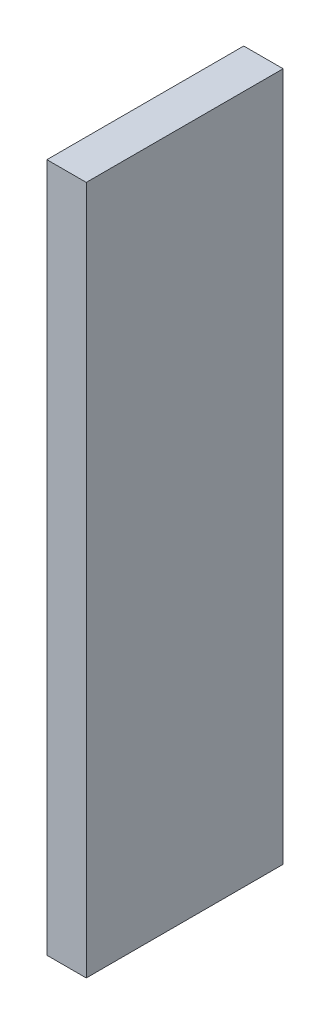
ISO-10303-21;
HEADER;
FILE_DESCRIPTION(('STEP AP214'),'2;1');
FILE_NAME('part.step','',(''),(''),'','','');
FILE_SCHEMA(('AUTOMOTIVE_DESIGN { 1 0 10303 214 1 1 1 1 }'));
ENDSEC;
DATA;
#1=APPLICATION_CONTEXT('core data for automotive mechanical design processes');
#2=APPLICATION_PROTOCOL_DEFINITION('international standard','automotive_design',2000,#1);
#3=PRODUCT_CONTEXT('',#1,'mechanical');
#4=PRODUCT('Part','Part','',(#3));
#5=PRODUCT_RELATED_PRODUCT_CATEGORY('part','',(#4));
#6=PRODUCT_DEFINITION_FORMATION('','',#4);
#7=PRODUCT_DEFINITION_CONTEXT('part definition',#1,'design');
#8=PRODUCT_DEFINITION('design','',#6,#7);
#9=PRODUCT_DEFINITION_SHAPE('','',#8);
#10=(LENGTH_UNIT() NAMED_UNIT(*) SI_UNIT(.MILLI.,.METRE.));
#11=(NAMED_UNIT(*) PLANE_ANGLE_UNIT() SI_UNIT($,.RADIAN.));
#12=(NAMED_UNIT(*) SI_UNIT($,.STERADIAN.) SOLID_ANGLE_UNIT());
#13=UNCERTAINTY_MEASURE_WITH_UNIT(LENGTH_MEASURE(1.E-05),#10,'distance_accuracy_value','');
#14=(GEOMETRIC_REPRESENTATION_CONTEXT(3) GLOBAL_UNCERTAINTY_ASSIGNED_CONTEXT((#13)) GLOBAL_UNIT_ASSIGNED_CONTEXT((#10,
#11,#12)) REPRESENTATION_CONTEXT('',''));
#15=CARTESIAN_POINT('',(0.,0.,0.));
#16=DIRECTION('',(0.,0.,1.));
#17=DIRECTION('',(1.,0.,0.));
#18=AXIS2_PLACEMENT_3D('',#15,#16,#17);
#19=CARTESIAN_POINT('',(-1.27,-22.225,0.));
#20=DIRECTION('',(-1.,0.,0.));
#21=DIRECTION('',(0.,0.,1.));
#22=AXIS2_PLACEMENT_3D('',#19,#20,#21);
#23=PLANE('',#22);
#24=DIRECTION('',(0.,0.,1.));
#25=VECTOR('',#24,1.);
#26=CARTESIAN_POINT('',(-1.27,22.225,0.));
#27=LINE('',#26,#25);
#28=CARTESIAN_POINT('',(-1.27,22.225,0.));
#29=VERTEX_POINT('',#28);
#30=CARTESIAN_POINT('',(-1.27,22.225,12.7));
#31=VERTEX_POINT('',#30);
#32=EDGE_CURVE('E20',#29,#31,#27,.T.);
#33=ORIENTED_EDGE('',*,*,#32,.F.);
#34=DIRECTION('',(0.,1.,0.));
#35=VECTOR('',#34,1.);
#36=CARTESIAN_POINT('',(-1.27,22.225,0.));
#37=LINE('',#36,#35);
#38=CARTESIAN_POINT('',(-1.27,-22.225,0.));
#39=VERTEX_POINT('',#38);
#40=EDGE_CURVE('E80',#29,#39,#37,.F.);
#41=ORIENTED_EDGE('',*,*,#40,.T.);
#42=DIRECTION('',(0.,0.,-1.));
#43=VECTOR('',#42,1.);
#44=CARTESIAN_POINT('',(-1.27,-22.225,0.));
#45=LINE('',#44,#43);
#46=CARTESIAN_POINT('',(-1.27,-22.225,12.7));
#47=VERTEX_POINT('',#46);
#48=EDGE_CURVE('E68',#47,#39,#45,.T.);
#49=ORIENTED_EDGE('',*,*,#48,.F.);
#50=DIRECTION('',(0.,1.,0.));
#51=VECTOR('',#50,1.);
#52=CARTESIAN_POINT('',(-1.27,22.225,12.7));
#53=LINE('',#52,#51);
#54=EDGE_CURVE('E56',#31,#47,#53,.F.);
#55=ORIENTED_EDGE('',*,*,#54,.F.);
#56=EDGE_LOOP('',(#33,#41,#49,#55));
#57=FACE_BOUND('',#56,.T.);
#58=ADVANCED_FACE('F17',(#57),#23,.T.);
#59=CARTESIAN_POINT('',(-1.27,22.225,0.));
#60=DIRECTION('',(0.,1.,0.));
#61=DIRECTION('',(0.,0.,1.));
#62=AXIS2_PLACEMENT_3D('',#59,#60,#61);
#63=PLANE('',#62);
#64=DIRECTION('',(0.,0.,-1.));
#65=VECTOR('',#64,1.);
#66=CARTESIAN_POINT('',(1.27,22.225,0.));
#67=LINE('',#66,#65);
#68=CARTESIAN_POINT('',(1.27,22.225,0.));
#69=VERTEX_POINT('',#68);
#70=CARTESIAN_POINT('',(1.27,22.225,12.7));
#71=VERTEX_POINT('',#70);
#72=EDGE_CURVE('E83',#69,#71,#67,.F.);
#73=ORIENTED_EDGE('',*,*,#72,.F.);
#74=DIRECTION('',(1.,0.,0.));
#75=VECTOR('',#74,1.);
#76=CARTESIAN_POINT('',(1.27,22.225,0.));
#77=LINE('',#76,#75);
#78=EDGE_CURVE('E65',#69,#29,#77,.F.);
#79=ORIENTED_EDGE('',*,*,#78,.T.);
#80=ORIENTED_EDGE('',*,*,#32,.T.);
#81=DIRECTION('',(1.,0.,0.));
#82=VECTOR('',#81,1.);
#83=CARTESIAN_POINT('',(1.27,22.225,12.7));
#84=LINE('',#83,#82);
#85=EDGE_CURVE('E62',#71,#31,#84,.F.);
#86=ORIENTED_EDGE('',*,*,#85,.F.);
#87=EDGE_LOOP('',(#73,#79,#80,#86));
#88=FACE_BOUND('',#87,.T.);
#89=ADVANCED_FACE('F61',(#88),#63,.T.);
#90=CARTESIAN_POINT('',(1.27,22.225,12.7));
#91=DIRECTION('',(0.,0.,1.));
#92=DIRECTION('',(1.,0.,0.));
#93=AXIS2_PLACEMENT_3D('',#90,#91,#92);
#94=PLANE('',#93);
#95=DIRECTION('',(1.,0.,0.));
#96=VECTOR('',#95,1.);
#97=CARTESIAN_POINT('',(1.27,-22.225,12.7));
#98=LINE('',#97,#96);
#99=CARTESIAN_POINT('',(1.27,-22.225,12.7));
#100=VERTEX_POINT('',#99);
#101=EDGE_CURVE('E70',#100,#47,#98,.F.);
#102=ORIENTED_EDGE('',*,*,#101,.F.);
#103=DIRECTION('',(0.,1.,0.));
#104=VECTOR('',#103,1.);
#105=CARTESIAN_POINT('',(1.27,22.225,12.7));
#106=LINE('',#105,#104);
#107=EDGE_CURVE('E74',#71,#100,#106,.F.);
#108=ORIENTED_EDGE('',*,*,#107,.F.);
#109=ORIENTED_EDGE('',*,*,#85,.T.);
#110=ORIENTED_EDGE('',*,*,#54,.T.);
#111=EDGE_LOOP('',(#102,#108,#109,#110));
#112=FACE_BOUND('',#111,.T.);
#113=ADVANCED_FACE('F72',(#112),#94,.T.);
#114=CARTESIAN_POINT('',(1.27,-22.225,0.));
#115=DIRECTION('',(0.,-1.,0.));
#116=DIRECTION('',(0.,0.,-1.));
#117=AXIS2_PLACEMENT_3D('',#114,#115,#116);
#118=PLANE('',#117);
#119=ORIENTED_EDGE('',*,*,#48,.T.);
#120=DIRECTION('',(1.,0.,0.));
#121=VECTOR('',#120,1.);
#122=CARTESIAN_POINT('',(1.27,-22.225,0.));
#123=LINE('',#122,#121);
#124=CARTESIAN_POINT('',(1.27,-22.225,0.));
#125=VERTEX_POINT('',#124);
#126=EDGE_CURVE('E35',#39,#125,#123,.T.);
#127=ORIENTED_EDGE('',*,*,#126,.T.);
#128=DIRECTION('',(0.,0.,-1.));
#129=VECTOR('',#128,1.);
#130=CARTESIAN_POINT('',(1.27,-22.225,0.));
#131=LINE('',#130,#129);
#132=EDGE_CURVE('E26',#100,#125,#131,.T.);
#133=ORIENTED_EDGE('',*,*,#132,.F.);
#134=ORIENTED_EDGE('',*,*,#101,.T.);
#135=EDGE_LOOP('',(#119,#127,#133,#134));
#136=FACE_BOUND('',#135,.T.);
#137=ADVANCED_FACE('F89',(#136),#118,.T.);
#138=CARTESIAN_POINT('',(1.27,22.225,0.));
#139=DIRECTION('',(0.,0.,1.));
#140=DIRECTION('',(1.,0.,0.));
#141=AXIS2_PLACEMENT_3D('',#138,#139,#140);
#142=PLANE('',#141);
#143=ORIENTED_EDGE('',*,*,#126,.F.);
#144=ORIENTED_EDGE('',*,*,#40,.F.);
#145=ORIENTED_EDGE('',*,*,#78,.F.);
#146=DIRECTION('',(0.,1.,0.));
#147=VECTOR('',#146,1.);
#148=CARTESIAN_POINT('',(1.27,22.225,0.));
#149=LINE('',#148,#147);
#150=EDGE_CURVE('E11',#125,#69,#149,.T.);
#151=ORIENTED_EDGE('',*,*,#150,.F.);
#152=EDGE_LOOP('',(#143,#144,#145,#151));
#153=FACE_BOUND('',#152,.T.);
#154=ADVANCED_FACE('F91',(#153),#142,.F.);
#155=CARTESIAN_POINT('',(1.27,22.225,0.));
#156=DIRECTION('',(1.,0.,0.));
#157=DIRECTION('',(0.,0.,-1.));
#158=AXIS2_PLACEMENT_3D('',#155,#156,#157);
#159=PLANE('',#158);
#160=ORIENTED_EDGE('',*,*,#132,.T.);
#161=ORIENTED_EDGE('',*,*,#150,.T.);
#162=ORIENTED_EDGE('',*,*,#72,.T.);
#163=ORIENTED_EDGE('',*,*,#107,.T.);
#164=EDGE_LOOP('',(#160,#161,#162,#163));
#165=FACE_BOUND('',#164,.T.);
#166=ADVANCED_FACE('F88',(#165),#159,.T.);
#167=CLOSED_SHELL('',(#58,#89,#113,#137,#154,#166));
#168=MANIFOLD_SOLID_BREP('B1',#167);
#169=ADVANCED_BREP_SHAPE_REPRESENTATION('',(#18,#168),#14);
#170=SHAPE_DEFINITION_REPRESENTATION(#9,#169);
ENDSEC;
END-ISO-10303-21;
